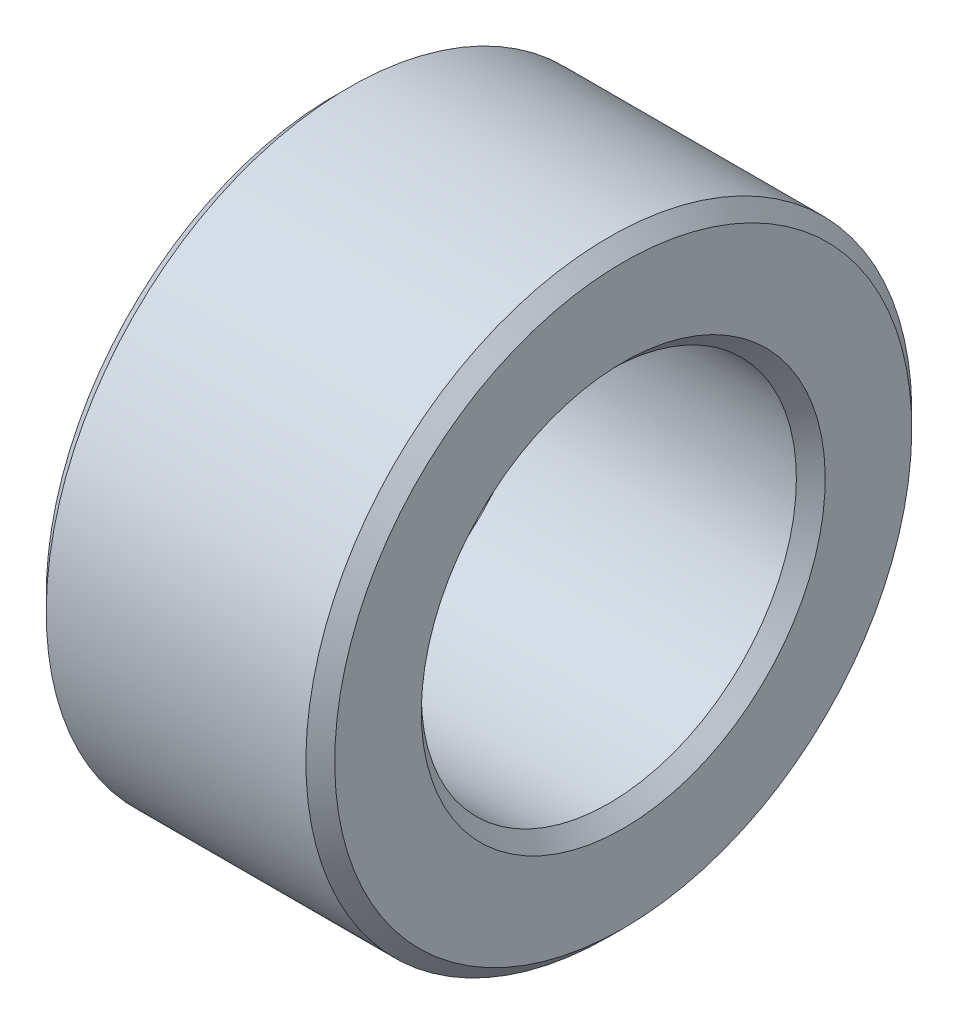
ISO-10303-21;
HEADER;
FILE_DESCRIPTION(('STEP AP214'),'2;1');
FILE_NAME('part.step','',(''),(''),'','','');
FILE_SCHEMA(('AUTOMOTIVE_DESIGN { 1 0 10303 214 1 1 1 1 }'));
ENDSEC;
DATA;
#1=APPLICATION_CONTEXT('core data for automotive mechanical design processes');
#2=APPLICATION_PROTOCOL_DEFINITION('international standard','automotive_design',2000,#1);
#3=PRODUCT_CONTEXT('',#1,'mechanical');
#4=PRODUCT('Part','Part','',(#3));
#5=PRODUCT_RELATED_PRODUCT_CATEGORY('part','',(#4));
#6=PRODUCT_DEFINITION_FORMATION('','',#4);
#7=PRODUCT_DEFINITION_CONTEXT('part definition',#1,'design');
#8=PRODUCT_DEFINITION('design','',#6,#7);
#9=PRODUCT_DEFINITION_SHAPE('','',#8);
#10=(LENGTH_UNIT() NAMED_UNIT(*) SI_UNIT(.MILLI.,.METRE.));
#11=(NAMED_UNIT(*) PLANE_ANGLE_UNIT() SI_UNIT($,.RADIAN.));
#12=(NAMED_UNIT(*) SI_UNIT($,.STERADIAN.) SOLID_ANGLE_UNIT());
#13=UNCERTAINTY_MEASURE_WITH_UNIT(LENGTH_MEASURE(1.E-05),#10,'distance_accuracy_value','');
#14=(GEOMETRIC_REPRESENTATION_CONTEXT(3) GLOBAL_UNCERTAINTY_ASSIGNED_CONTEXT((#13)) GLOBAL_UNIT_ASSIGNED_CONTEXT((#10,
#11,#12)) REPRESENTATION_CONTEXT('',''));
#15=CARTESIAN_POINT('',(0.,0.,0.));
#16=DIRECTION('',(0.,0.,1.));
#17=DIRECTION('',(1.,0.,0.));
#18=AXIS2_PLACEMENT_3D('',#15,#16,#17);
#19=CARTESIAN_POINT('',(-27.4,0.,0.));
#20=DIRECTION('',(-1.,0.,0.));
#21=DIRECTION('',(0.,1.,0.));
#22=AXIS2_PLACEMENT_3D('',#19,#20,#21);
#23=CONICAL_SURFACE('',#22,2.7,0.785398163397449);
#24=CARTESIAN_POINT('',(-27.3,0.,0.));
#25=DIRECTION('',(1.,0.,0.));
#26=DIRECTION('',(0.,1.,0.));
#27=AXIS2_PLACEMENT_3D('',#24,#25,#26);
#28=CIRCLE('',#27,2.6);
#29=CARTESIAN_POINT('',(-27.3,-2.6,0.));
#30=VERTEX_POINT('',#29);
#31=EDGE_CURVE('E84',#30,#30,#28,.T.);
#32=ORIENTED_EDGE('',*,*,#31,.T.);
#33=DIRECTION('',(-0.707106781186547,-0.707106781186548,0.));
#34=VECTOR('',#33,1.);
#35=CARTESIAN_POINT('',(-27.4,-2.7,0.));
#36=LINE('',#35,#34);
#37=CARTESIAN_POINT('',(-27.5,-2.8,0.));
#38=VERTEX_POINT('',#37);
#39=EDGE_CURVE('E11',#30,#38,#36,.T.);
#40=ORIENTED_EDGE('',*,*,#39,.T.);
#41=CARTESIAN_POINT('',(-27.5,0.,0.));
#42=DIRECTION('',(-1.,0.,0.));
#43=DIRECTION('',(0.,1.,0.));
#44=AXIS2_PLACEMENT_3D('',#41,#42,#43);
#45=CIRCLE('',#44,2.8);
#46=EDGE_CURVE('E25',#38,#38,#45,.T.);
#47=ORIENTED_EDGE('',*,*,#46,.T.);
#48=ORIENTED_EDGE('',*,*,#39,.F.);
#49=EDGE_LOOP('',(#32,#40,#47,#48));
#50=FACE_BOUND('',#49,.T.);
#51=ADVANCED_FACE('F16',(#50),#23,.F.);
#52=CARTESIAN_POINT('',(-27.5,0.,0.));
#53=DIRECTION('',(1.,0.,0.));
#54=DIRECTION('',(0.,1.,0.));
#55=AXIS2_PLACEMENT_3D('',#52,#53,#54);
#56=PLANE('',#55);
#57=ORIENTED_EDGE('',*,*,#46,.F.);
#58=EDGE_LOOP('',(#57));
#59=FACE_BOUND('',#58,.T.);
#60=CARTESIAN_POINT('',(-27.5,0.,0.));
#61=DIRECTION('',(1.,0.,0.));
#62=DIRECTION('',(0.,1.,0.));
#63=AXIS2_PLACEMENT_3D('',#60,#61,#62);
#64=CIRCLE('',#63,4.);
#65=CARTESIAN_POINT('',(-27.5,-4.,0.));
#66=VERTEX_POINT('',#65);
#67=EDGE_CURVE('E47',#66,#66,#64,.T.);
#68=ORIENTED_EDGE('',*,*,#67,.F.);
#69=EDGE_LOOP('',(#68));
#70=FACE_BOUND('',#69,.T.);
#71=ADVANCED_FACE('F18',(#59,#70),#56,.F.);
#72=CARTESIAN_POINT('',(-27.4,0.,0.));
#73=DIRECTION('',(1.,0.,0.));
#74=DIRECTION('',(0.,1.,0.));
#75=AXIS2_PLACEMENT_3D('',#72,#73,#74);
#76=CONICAL_SURFACE('',#75,4.1,0.785398163397449);
#77=CARTESIAN_POINT('',(-27.3,0.,0.));
#78=DIRECTION('',(-1.,0.,0.));
#79=DIRECTION('',(0.,1.,0.));
#80=AXIS2_PLACEMENT_3D('',#77,#78,#79);
#81=CIRCLE('',#80,4.2);
#82=CARTESIAN_POINT('',(-27.3,-4.2,0.));
#83=VERTEX_POINT('',#82);
#84=EDGE_CURVE('E72',#83,#83,#81,.T.);
#85=ORIENTED_EDGE('',*,*,#84,.T.);
#86=DIRECTION('',(-0.707106781186548,0.707106781186547,0.));
#87=VECTOR('',#86,1.);
#88=CARTESIAN_POINT('',(-27.4,-4.1,0.));
#89=LINE('',#88,#87);
#90=EDGE_CURVE('E89',#83,#66,#89,.T.);
#91=ORIENTED_EDGE('',*,*,#90,.T.);
#92=ORIENTED_EDGE('',*,*,#67,.T.);
#93=ORIENTED_EDGE('',*,*,#90,.F.);
#94=EDGE_LOOP('',(#85,#91,#92,#93));
#95=FACE_BOUND('',#94,.T.);
#96=ADVANCED_FACE('F149',(#95),#76,.T.);
#97=CARTESIAN_POINT('',(-27.5,0.,0.));
#98=DIRECTION('',(1.,0.,0.));
#99=DIRECTION('',(0.,1.,0.));
#100=AXIS2_PLACEMENT_3D('',#97,#98,#99);
#101=CYLINDRICAL_SURFACE('',#100,4.2);
#102=CARTESIAN_POINT('',(-23.7,0.,0.));
#103=DIRECTION('',(1.,0.,0.));
#104=DIRECTION('',(0.,1.,0.));
#105=AXIS2_PLACEMENT_3D('',#102,#103,#104);
#106=CIRCLE('',#105,4.2);
#107=CARTESIAN_POINT('',(-23.7,-4.2,0.));
#108=VERTEX_POINT('',#107);
#109=EDGE_CURVE('E69',#108,#108,#106,.T.);
#110=ORIENTED_EDGE('',*,*,#109,.F.);
#111=DIRECTION('',(-1.,0.,0.));
#112=VECTOR('',#111,1.);
#113=CARTESIAN_POINT('',(-27.5,-4.2,0.));
#114=LINE('',#113,#112);
#115=EDGE_CURVE('E66',#108,#83,#114,.T.);
#116=ORIENTED_EDGE('',*,*,#115,.T.);
#117=ORIENTED_EDGE('',*,*,#84,.F.);
#118=ORIENTED_EDGE('',*,*,#115,.F.);
#119=EDGE_LOOP('',(#110,#116,#117,#118));
#120=FACE_BOUND('',#119,.T.);
#121=ADVANCED_FACE('F68',(#120),#101,.T.);
#122=CARTESIAN_POINT('',(-23.6,0.,0.));
#123=DIRECTION('',(-1.,0.,0.));
#124=DIRECTION('',(0.,1.,0.));
#125=AXIS2_PLACEMENT_3D('',#122,#123,#124);
#126=CONICAL_SURFACE('',#125,4.1,0.785398163397448);
#127=CARTESIAN_POINT('',(-23.5,0.,0.));
#128=DIRECTION('',(-1.,0.,0.));
#129=DIRECTION('',(0.,1.,0.));
#130=AXIS2_PLACEMENT_3D('',#127,#128,#129);
#131=CIRCLE('',#130,4.);
#132=CARTESIAN_POINT('',(-23.5,-4.,0.));
#133=VERTEX_POINT('',#132);
#134=EDGE_CURVE('E99',#133,#133,#131,.T.);
#135=ORIENTED_EDGE('',*,*,#134,.T.);
#136=DIRECTION('',(-0.707106781186547,-0.707106781186548,0.));
#137=VECTOR('',#136,1.);
#138=CARTESIAN_POINT('',(-23.6,-4.1,0.));
#139=LINE('',#138,#137);
#140=EDGE_CURVE('E78',#133,#108,#139,.T.);
#141=ORIENTED_EDGE('',*,*,#140,.T.);
#142=ORIENTED_EDGE('',*,*,#109,.T.);
#143=ORIENTED_EDGE('',*,*,#140,.F.);
#144=EDGE_LOOP('',(#135,#141,#142,#143));
#145=FACE_BOUND('',#144,.T.);
#146=ADVANCED_FACE('F77',(#145),#126,.T.);
#147=CARTESIAN_POINT('',(-27.5,0.,0.));
#148=DIRECTION('',(1.,0.,0.));
#149=DIRECTION('',(0.,1.,0.));
#150=AXIS2_PLACEMENT_3D('',#147,#148,#149);
#151=CYLINDRICAL_SURFACE('',#150,2.6);
#152=CARTESIAN_POINT('',(-23.7,0.,0.));
#153=DIRECTION('',(-1.,0.,0.));
#154=DIRECTION('',(0.,1.,0.));
#155=AXIS2_PLACEMENT_3D('',#152,#153,#154);
#156=CIRCLE('',#155,2.6);
#157=CARTESIAN_POINT('',(-23.7,-2.6,0.));
#158=VERTEX_POINT('',#157);
#159=EDGE_CURVE('E111',#158,#158,#156,.T.);
#160=ORIENTED_EDGE('',*,*,#159,.F.);
#161=DIRECTION('',(-1.,0.,0.));
#162=VECTOR('',#161,1.);
#163=CARTESIAN_POINT('',(-27.5,-2.6,0.));
#164=LINE('',#163,#162);
#165=EDGE_CURVE('E101',#158,#30,#164,.T.);
#166=ORIENTED_EDGE('',*,*,#165,.T.);
#167=ORIENTED_EDGE('',*,*,#31,.F.);
#168=ORIENTED_EDGE('',*,*,#165,.F.);
#169=EDGE_LOOP('',(#160,#166,#167,#168));
#170=FACE_BOUND('',#169,.T.);
#171=ADVANCED_FACE('F136',(#170),#151,.F.);
#172=CARTESIAN_POINT('',(-23.5,0.,0.));
#173=DIRECTION('',(1.,0.,0.));
#174=DIRECTION('',(0.,1.,0.));
#175=AXIS2_PLACEMENT_3D('',#172,#173,#174);
#176=PLANE('',#175);
#177=CARTESIAN_POINT('',(-23.5,0.,0.));
#178=DIRECTION('',(1.,0.,0.));
#179=DIRECTION('',(0.,1.,0.));
#180=AXIS2_PLACEMENT_3D('',#177,#178,#179);
#181=CIRCLE('',#180,2.8);
#182=CARTESIAN_POINT('',(-23.5,-2.8,0.));
#183=VERTEX_POINT('',#182);
#184=EDGE_CURVE('E122',#183,#183,#181,.T.);
#185=ORIENTED_EDGE('',*,*,#184,.F.);
#186=EDGE_LOOP('',(#185));
#187=FACE_BOUND('',#186,.T.);
#188=ORIENTED_EDGE('',*,*,#134,.F.);
#189=EDGE_LOOP('',(#188));
#190=FACE_BOUND('',#189,.T.);
#191=ADVANCED_FACE('F133',(#187,#190),#176,.T.);
#192=CARTESIAN_POINT('',(-23.6,0.,0.));
#193=DIRECTION('',(1.,0.,0.));
#194=DIRECTION('',(0.,1.,0.));
#195=AXIS2_PLACEMENT_3D('',#192,#193,#194);
#196=CONICAL_SURFACE('',#195,2.7,0.785398163397448);
#197=ORIENTED_EDGE('',*,*,#184,.T.);
#198=DIRECTION('',(-0.707106781186548,0.707106781186547,0.));
#199=VECTOR('',#198,1.);
#200=CARTESIAN_POINT('',(-23.6,-2.7,0.));
#201=LINE('',#200,#199);
#202=EDGE_CURVE('E116',#183,#158,#201,.T.);
#203=ORIENTED_EDGE('',*,*,#202,.T.);
#204=ORIENTED_EDGE('',*,*,#159,.T.);
#205=ORIENTED_EDGE('',*,*,#202,.F.);
#206=EDGE_LOOP('',(#197,#203,#204,#205));
#207=FACE_BOUND('',#206,.T.);
#208=ADVANCED_FACE('F130',(#207),#196,.F.);
#209=CLOSED_SHELL('',(#51,#71,#96,#121,#146,#171,#191,#208));
#210=MANIFOLD_SOLID_BREP('B1',#209);
#211=ADVANCED_BREP_SHAPE_REPRESENTATION('',(#18,#210),#14);
#212=SHAPE_DEFINITION_REPRESENTATION(#9,#211);
ENDSEC;
END-ISO-10303-21;
